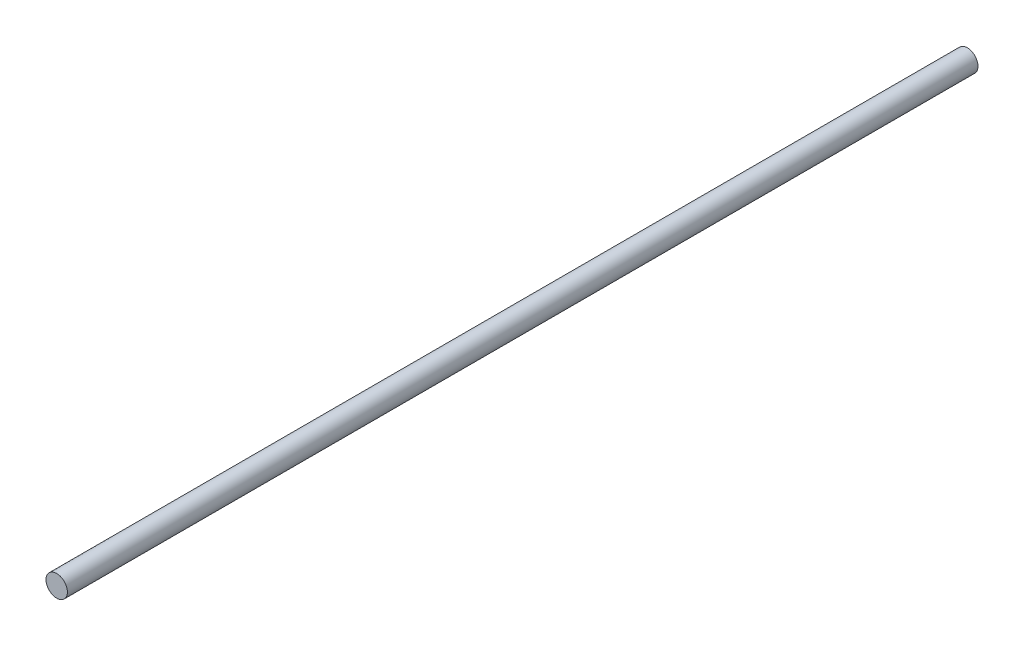
ISO-10303-21;
HEADER;
FILE_DESCRIPTION(('STEP AP214'),'2;1');
FILE_NAME('part.step','',(''),(''),'','','');
FILE_SCHEMA(('AUTOMOTIVE_DESIGN { 1 0 10303 214 1 1 1 1 }'));
ENDSEC;
DATA;
#1=APPLICATION_CONTEXT('core data for automotive mechanical design processes');
#2=APPLICATION_PROTOCOL_DEFINITION('international standard','automotive_design',2000,#1);
#3=PRODUCT_CONTEXT('',#1,'mechanical');
#4=PRODUCT('Part','Part','',(#3));
#5=PRODUCT_RELATED_PRODUCT_CATEGORY('part','',(#4));
#6=PRODUCT_DEFINITION_FORMATION('','',#4);
#7=PRODUCT_DEFINITION_CONTEXT('part definition',#1,'design');
#8=PRODUCT_DEFINITION('design','',#6,#7);
#9=PRODUCT_DEFINITION_SHAPE('','',#8);
#10=(LENGTH_UNIT() NAMED_UNIT(*) SI_UNIT(.MILLI.,.METRE.));
#11=(NAMED_UNIT(*) PLANE_ANGLE_UNIT() SI_UNIT($,.RADIAN.));
#12=(NAMED_UNIT(*) SI_UNIT($,.STERADIAN.) SOLID_ANGLE_UNIT());
#13=UNCERTAINTY_MEASURE_WITH_UNIT(LENGTH_MEASURE(1.E-05),#10,'distance_accuracy_value','');
#14=(GEOMETRIC_REPRESENTATION_CONTEXT(3) GLOBAL_UNCERTAINTY_ASSIGNED_CONTEXT((#13)) GLOBAL_UNIT_ASSIGNED_CONTEXT((#10,
#11,#12)) REPRESENTATION_CONTEXT('',''));
#15=CARTESIAN_POINT('',(0.,0.,0.));
#16=DIRECTION('',(0.,0.,1.));
#17=DIRECTION('',(1.,0.,0.));
#18=AXIS2_PLACEMENT_3D('',#15,#16,#17);
#19=CARTESIAN_POINT('',(0.,0.,170.));
#20=DIRECTION('',(0.,0.,-1.));
#21=DIRECTION('',(-1.,0.,0.));
#22=AXIS2_PLACEMENT_3D('',#19,#20,#21);
#23=CYLINDRICAL_SURFACE('',#22,4.);
#24=CARTESIAN_POINT('',(0.,0.,170.));
#25=DIRECTION('',(0.,0.,1.));
#26=DIRECTION('',(1.,0.,0.));
#27=AXIS2_PLACEMENT_3D('',#24,#25,#26);
#28=CIRCLE('',#27,4.);
#29=CARTESIAN_POINT('',(4.,0.,170.));
#30=VERTEX_POINT('',#29);
#31=EDGE_CURVE('E10',#30,#30,#28,.T.);
#32=ORIENTED_EDGE('',*,*,#31,.F.);
#33=EDGE_LOOP('',(#32));
#34=FACE_BOUND('',#33,.T.);
#35=CARTESIAN_POINT('',(0.,0.,-170.));
#36=DIRECTION('',(0.,0.,1.));
#37=DIRECTION('',(1.,0.,0.));
#38=AXIS2_PLACEMENT_3D('',#35,#36,#37);
#39=CIRCLE('',#38,4.);
#40=CARTESIAN_POINT('',(4.,0.,-170.));
#41=VERTEX_POINT('',#40);
#42=EDGE_CURVE('E17',#41,#41,#39,.T.);
#43=ORIENTED_EDGE('',*,*,#42,.T.);
#44=EDGE_LOOP('',(#43));
#45=FACE_BOUND('',#44,.T.);
#46=ADVANCED_FACE('F14',(#34,#45),#23,.T.);
#47=CARTESIAN_POINT('',(0.,0.,170.));
#48=DIRECTION('',(0.,0.,1.));
#49=DIRECTION('',(1.,0.,0.));
#50=AXIS2_PLACEMENT_3D('',#47,#48,#49);
#51=PLANE('',#50);
#52=ORIENTED_EDGE('',*,*,#31,.T.);
#53=EDGE_LOOP('',(#52));
#54=FACE_BOUND('',#53,.T.);
#55=ADVANCED_FACE('F29',(#54),#51,.T.);
#56=CARTESIAN_POINT('',(0.,0.,-170.));
#57=DIRECTION('',(0.,0.,1.));
#58=DIRECTION('',(1.,0.,0.));
#59=AXIS2_PLACEMENT_3D('',#56,#57,#58);
#60=PLANE('',#59);
#61=ORIENTED_EDGE('',*,*,#42,.F.);
#62=EDGE_LOOP('',(#61));
#63=FACE_BOUND('',#62,.T.);
#64=ADVANCED_FACE('F27',(#63),#60,.F.);
#65=CLOSED_SHELL('',(#46,#55,#64));
#66=MANIFOLD_SOLID_BREP('B1',#65);
#67=ADVANCED_BREP_SHAPE_REPRESENTATION('',(#18,#66),#14);
#68=SHAPE_DEFINITION_REPRESENTATION(#9,#67);
ENDSEC;
END-ISO-10303-21;
